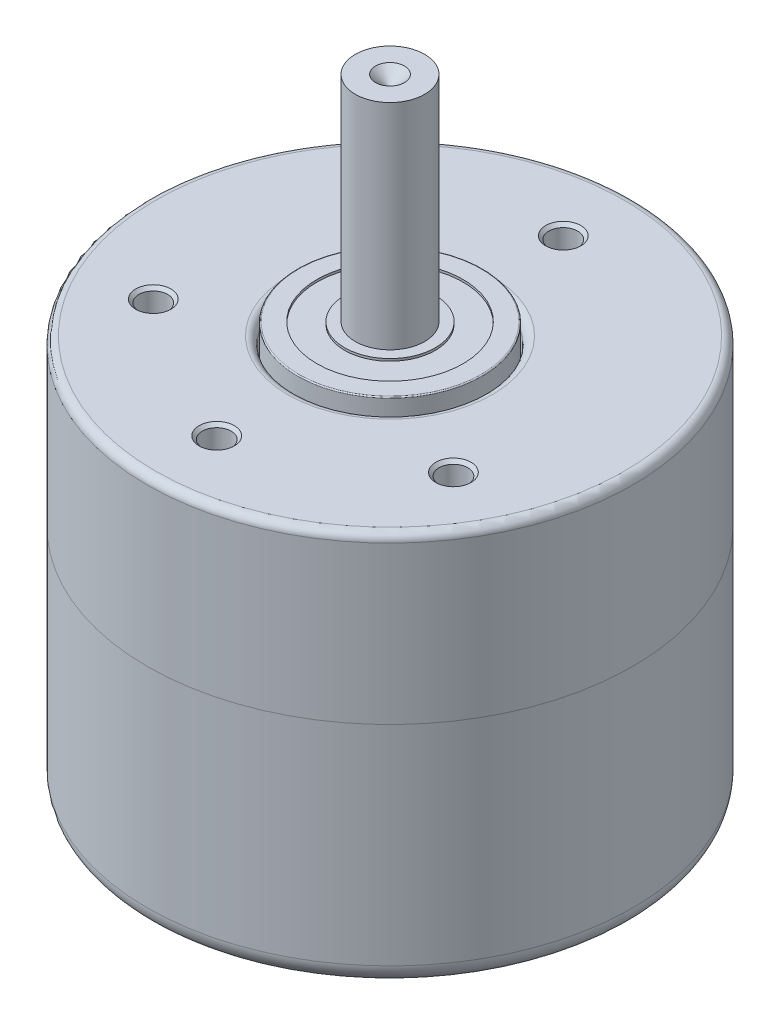
ISO-10303-21;
HEADER;
FILE_DESCRIPTION(('STEP AP214'),'2;1');
FILE_NAME('part.step','',(''),(''),'','','');
FILE_SCHEMA(('AUTOMOTIVE_DESIGN { 1 0 10303 214 1 1 1 1 }'));
ENDSEC;
DATA;
#1=APPLICATION_CONTEXT('core data for automotive mechanical design processes');
#2=APPLICATION_PROTOCOL_DEFINITION('international standard','automotive_design',2000,#1);
#3=PRODUCT_CONTEXT('',#1,'mechanical');
#4=PRODUCT('Part','Part','',(#3));
#5=PRODUCT_RELATED_PRODUCT_CATEGORY('part','',(#4));
#6=PRODUCT_DEFINITION_FORMATION('','',#4);
#7=PRODUCT_DEFINITION_CONTEXT('part definition',#1,'design');
#8=PRODUCT_DEFINITION('design','',#6,#7);
#9=PRODUCT_DEFINITION_SHAPE('','',#8);
#10=(LENGTH_UNIT() NAMED_UNIT(*) SI_UNIT(.MILLI.,.METRE.));
#11=(NAMED_UNIT(*) PLANE_ANGLE_UNIT() SI_UNIT($,.RADIAN.));
#12=(NAMED_UNIT(*) SI_UNIT($,.STERADIAN.) SOLID_ANGLE_UNIT());
#13=UNCERTAINTY_MEASURE_WITH_UNIT(LENGTH_MEASURE(1.E-05),#10,'distance_accuracy_value','');
#14=(GEOMETRIC_REPRESENTATION_CONTEXT(3) GLOBAL_UNCERTAINTY_ASSIGNED_CONTEXT((#13)) GLOBAL_UNIT_ASSIGNED_CONTEXT((#10,
#11,#12)) REPRESENTATION_CONTEXT('',''));
#15=CARTESIAN_POINT('',(0.,0.,0.));
#16=DIRECTION('',(0.,0.,1.));
#17=DIRECTION('',(1.,0.,0.));
#18=AXIS2_PLACEMENT_3D('',#15,#16,#17);
#19=CARTESIAN_POINT('',(0.,-19.85,0.));
#20=DIRECTION('',(0.,1.,0.));
#21=DIRECTION('',(0.,0.,1.));
#22=AXIS2_PLACEMENT_3D('',#19,#20,#21);
#23=CYLINDRICAL_SURFACE('',#22,21.);
#24=CARTESIAN_POINT('',(0.,0.,0.));
#25=DIRECTION('',(0.,-1.,0.));
#26=DIRECTION('',(0.,0.,-1.));
#27=AXIS2_PLACEMENT_3D('',#24,#25,#26);
#28=CIRCLE('',#27,21.);
#29=CARTESIAN_POINT('',(0.,0.,-21.));
#30=VERTEX_POINT('',#29);
#31=EDGE_CURVE('P0_E89',#30,#30,#28,.T.);
#32=ORIENTED_EDGE('',*,*,#31,.T.);
#33=EDGE_LOOP('',(#32));
#34=FACE_BOUND('',#33,.T.);
#35=CARTESIAN_POINT('',(0.,-18.1,0.));
#36=DIRECTION('',(0.,-1.,0.));
#37=DIRECTION('',(0.,0.,-1.));
#38=AXIS2_PLACEMENT_3D('',#35,#36,#37);
#39=CIRCLE('',#38,21.);
#40=CARTESIAN_POINT('',(0.,-18.1,-21.));
#41=VERTEX_POINT('',#40);
#42=EDGE_CURVE('P0_E99',#41,#41,#39,.F.);
#43=ORIENTED_EDGE('',*,*,#42,.T.);
#44=EDGE_LOOP('',(#43));
#45=FACE_BOUND('',#44,.T.);
#46=CARTESIAN_POINT('',(0.,-6.35,0.));
#47=DIRECTION('',(0.,-1.,0.));
#48=DIRECTION('',(0.,0.,-1.));
#49=AXIS2_PLACEMENT_3D('',#46,#47,#48);
#50=CIRCLE('',#49,21.);
#51=CARTESIAN_POINT('',(-20.7903516829014,-6.35,2.95994542201031));
#52=VERTEX_POINT('',#51);
#53=CARTESIAN_POINT('',(-12.9585637707271,-6.35,-16.525));
#54=VERTEX_POINT('',#53);
#55=EDGE_CURVE('P0_E70',#52,#54,#50,.T.);
#56=ORIENTED_EDGE('',*,*,#55,.F.);
#57=DIRECTION('',(0.,-1.,0.));
#58=VECTOR('',#57,1.);
#59=CARTESIAN_POINT('',(-20.7903516829014,-6.35,2.95994542201031));
#60=LINE('',#59,#58);
#61=CARTESIAN_POINT('',(-20.7903516829014,-11.65,2.95994542201031));
#62=VERTEX_POINT('',#61);
#63=EDGE_CURVE('P0_E86',#52,#62,#60,.T.);
#64=ORIENTED_EDGE('',*,*,#63,.T.);
#65=CARTESIAN_POINT('',(0.,-11.65,0.));
#66=DIRECTION('',(0.,-1.,0.));
#67=DIRECTION('',(0.,0.,-1.));
#68=AXIS2_PLACEMENT_3D('',#65,#66,#67);
#69=CIRCLE('',#68,21.);
#70=CARTESIAN_POINT('',(-12.9585637707271,-11.65,-16.525));
#71=VERTEX_POINT('',#70);
#72=EDGE_CURVE('P0_E85',#62,#71,#69,.T.);
#73=ORIENTED_EDGE('',*,*,#72,.T.);
#74=DIRECTION('',(0.,-1.,0.));
#75=VECTOR('',#74,1.);
#76=CARTESIAN_POINT('',(-12.9585637707271,-6.35,-16.525));
#77=LINE('',#76,#75);
#78=EDGE_CURVE('P0_E81',#54,#71,#77,.T.);
#79=ORIENTED_EDGE('',*,*,#78,.F.);
#80=EDGE_LOOP('',(#56,#64,#73,#79));
#81=FACE_BOUND('',#80,.T.);
#82=ADVANCED_FACE('P0_F17',(#34,#45,#81),#23,.T.);
#83=CARTESIAN_POINT('',(0.,-19.85,0.));
#84=DIRECTION('',(0.,-1.,0.));
#85=DIRECTION('',(0.,0.,-1.));
#86=AXIS2_PLACEMENT_3D('',#83,#84,#85);
#87=PLANE('',#86);
#88=CARTESIAN_POINT('',(0.,-19.85,0.));
#89=DIRECTION('',(0.,-1.,0.));
#90=DIRECTION('',(0.,0.,-1.));
#91=AXIS2_PLACEMENT_3D('',#88,#89,#90);
#92=CIRCLE('',#91,19.25);
#93=CARTESIAN_POINT('',(0.,-19.85,-19.25));
#94=VERTEX_POINT('',#93);
#95=EDGE_CURVE('P0_E96',#94,#94,#92,.T.);
#96=ORIENTED_EDGE('',*,*,#95,.T.);
#97=EDGE_LOOP('',(#96));
#98=FACE_BOUND('',#97,.T.);
#99=ADVANCED_FACE('P0_F143',(#98),#87,.T.);
#100=CARTESIAN_POINT('',(0.,0.,0.));
#101=DIRECTION('',(0.,-1.,0.));
#102=DIRECTION('',(0.,0.,-1.));
#103=AXIS2_PLACEMENT_3D('',#100,#101,#102);
#104=PLANE('',#103);
#105=ORIENTED_EDGE('',*,*,#31,.F.);
#106=EDGE_LOOP('',(#105));
#107=FACE_BOUND('',#106,.T.);
#108=ADVANCED_FACE('P0_F149',(#107),#104,.F.);
#109=CARTESIAN_POINT('',(0.,-18.1,0.));
#110=DIRECTION('',(0.,-1.,0.));
#111=DIRECTION('',(0.,0.,-1.));
#112=AXIS2_PLACEMENT_3D('',#109,#110,#111);
#113=TOROIDAL_SURFACE('',#112,19.25,1.75);
#114=ORIENTED_EDGE('',*,*,#42,.F.);
#115=EDGE_LOOP('',(#114));
#116=FACE_BOUND('',#115,.T.);
#117=ORIENTED_EDGE('',*,*,#95,.F.);
#118=EDGE_LOOP('',(#117));
#119=FACE_BOUND('',#118,.T.);
#120=ADVANCED_FACE('P0_F155',(#116,#119),#113,.T.);
#121=CARTESIAN_POINT('',(3.91589395608716,-6.35,-9.74247271100514));
#122=DIRECTION('',(-0.372942281532111,0.,0.927854543905252));
#123=DIRECTION('',(0.927854543905252,0.,0.372942281532111));
#124=AXIS2_PLACEMENT_3D('',#121,#122,#123);
#125=PLANE('',#124);
#126=DIRECTION('',(-0.927854543905252,0.,-0.37294228153211));
#127=VECTOR('',#126,1.);
#128=CARTESIAN_POINT('',(3.91589395608716,-11.65,-9.74247271100514));
#129=LINE('',#128,#127);
#130=CARTESIAN_POINT('',(-19.1876841871536,-11.65,-19.0287355211547));
#131=VERTEX_POINT('',#130);
#132=EDGE_CURVE('P0_E135',#71,#131,#129,.T.);
#133=ORIENTED_EDGE('',*,*,#132,.T.);
#134=DIRECTION('',(0.,1.,0.));
#135=VECTOR('',#134,1.);
#136=CARTESIAN_POINT('',(-19.1876841871536,-6.35,-19.0287355211547));
#137=LINE('',#136,#135);
#138=CARTESIAN_POINT('',(-19.1876841871536,-6.35,-19.0287355211547));
#139=VERTEX_POINT('',#138);
#140=EDGE_CURVE('P0_E11',#131,#139,#137,.T.);
#141=ORIENTED_EDGE('',*,*,#140,.T.);
#142=DIRECTION('',(-0.927854543905252,0.,-0.37294228153211));
#143=VECTOR('',#142,1.);
#144=CARTESIAN_POINT('',(3.91589395608716,-6.35,-9.74247271100514));
#145=LINE('',#144,#143);
#146=EDGE_CURVE('P0_E72',#54,#139,#145,.T.);
#147=ORIENTED_EDGE('',*,*,#146,.F.);
#148=ORIENTED_EDGE('',*,*,#78,.T.);
#149=EDGE_LOOP('',(#133,#141,#147,#148));
#150=FACE_BOUND('',#149,.T.);
#151=ADVANCED_FACE('P0_F80',(#150),#125,.F.);
#152=CARTESIAN_POINT('',(-23.3819345064124,-6.35,-9.39814549460919));
#153=DIRECTION('',(-0.927854543905252,0.,-0.372942281532111));
#154=DIRECTION('',(-0.372942281532111,0.,0.927854543905252));
#155=AXIS2_PLACEMENT_3D('',#152,#153,#154);
#156=PLANE('',#155);
#157=DIRECTION('',(0.372942281532111,0.,-0.927854543905252));
#158=VECTOR('',#157,1.);
#159=CARTESIAN_POINT('',(-23.3819345064124,-11.65,-9.39814549460919));
#160=LINE('',#159,#158);
#161=CARTESIAN_POINT('',(-27.1859457780399,-11.65,0.0659708532244115));
#162=VERTEX_POINT('',#161);
#163=CARTESIAN_POINT('',(-19.5779232347848,-11.65,-18.8622618424427));
#164=VERTEX_POINT('',#163);
#165=EDGE_CURVE('P0_E83',#162,#164,#160,.T.);
#166=ORIENTED_EDGE('',*,*,#165,.F.);
#167=DIRECTION('',(0.,1.,0.));
#168=VECTOR('',#167,1.);
#169=CARTESIAN_POINT('',(-27.1859457780399,-6.35,0.0659708532244081));
#170=LINE('',#169,#168);
#171=CARTESIAN_POINT('',(-27.1859457780399,-6.35,0.0659708532244115));
#172=VERTEX_POINT('',#171);
#173=EDGE_CURVE('P0_E112',#162,#172,#170,.T.);
#174=ORIENTED_EDGE('',*,*,#173,.T.);
#175=DIRECTION('',(0.372942281532111,0.,-0.927854543905252));
#176=VECTOR('',#175,1.);
#177=CARTESIAN_POINT('',(-23.3819345064124,-6.35,-9.39814549460919));
#178=LINE('',#177,#176);
#179=CARTESIAN_POINT('',(-19.5779232347848,-6.35,-18.8622618424427));
#180=VERTEX_POINT('',#179);
#181=EDGE_CURVE('P0_E87',#172,#180,#178,.T.);
#182=ORIENTED_EDGE('',*,*,#181,.T.);
#183=DIRECTION('',(0.,-1.,0.));
#184=VECTOR('',#183,1.);
#185=CARTESIAN_POINT('',(-19.5779232347848,-11.65,-18.8622618424427));
#186=LINE('',#185,#184);
#187=EDGE_CURVE('P0_E109',#180,#164,#186,.T.);
#188=ORIENTED_EDGE('',*,*,#187,.T.);
#189=EDGE_LOOP('',(#166,#174,#182,#188));
#190=FACE_BOUND('',#189,.T.);
#191=ADVANCED_FACE('P0_F130',(#190),#156,.T.);
#192=CARTESIAN_POINT('',(-3.91589395608717,-6.35,9.74247271100517));
#193=DIRECTION('',(-0.372942281532111,0.,0.927854543905252));
#194=DIRECTION('',(0.927854543905252,0.,0.372942281532111));
#195=AXIS2_PLACEMENT_3D('',#192,#193,#194);
#196=PLANE('',#195);
#197=DIRECTION('',(-0.927854543905252,0.,-0.372942281532111));
#198=VECTOR('',#197,1.);
#199=CARTESIAN_POINT('',(-3.91589395608717,-6.35,9.74247271100517));
#200=LINE('',#199,#198);
#201=CARTESIAN_POINT('',(-27.019472099328,-6.35,0.456209900855603));
#202=VERTEX_POINT('',#201);
#203=EDGE_CURVE('P0_E74',#52,#202,#200,.T.);
#204=ORIENTED_EDGE('',*,*,#203,.T.);
#205=DIRECTION('',(0.,-1.,0.));
#206=VECTOR('',#205,1.);
#207=CARTESIAN_POINT('',(-27.019472099328,-6.35,0.456209900855603));
#208=LINE('',#207,#206);
#209=CARTESIAN_POINT('',(-27.019472099328,-11.65,0.456209900855603));
#210=VERTEX_POINT('',#209);
#211=EDGE_CURVE('P0_E102',#202,#210,#208,.T.);
#212=ORIENTED_EDGE('',*,*,#211,.T.);
#213=DIRECTION('',(-0.927854543905252,0.,-0.372942281532111));
#214=VECTOR('',#213,1.);
#215=CARTESIAN_POINT('',(-3.91589395608717,-11.65,9.74247271100517));
#216=LINE('',#215,#214);
#217=EDGE_CURVE('P0_E128',#62,#210,#216,.T.);
#218=ORIENTED_EDGE('',*,*,#217,.F.);
#219=ORIENTED_EDGE('',*,*,#63,.F.);
#220=EDGE_LOOP('',(#204,#212,#218,#219));
#221=FACE_BOUND('',#220,.T.);
#222=ADVANCED_FACE('P0_F119',(#221),#196,.T.);
#223=CARTESIAN_POINT('',(0.,-6.35,0.));
#224=DIRECTION('',(0.,-1.,0.));
#225=DIRECTION('',(0.,0.,-1.));
#226=AXIS2_PLACEMENT_3D('',#223,#224,#225);
#227=PLANE('',#226);
#228=ORIENTED_EDGE('',*,*,#181,.F.);
#229=DIRECTION('',(-0.392382223687617,0.,-0.919802256212693));
#230=VECTOR('',#229,1.);
#231=CARTESIAN_POINT('',(-27.019472099328,-6.35,0.456209900855603));
#232=LINE('',#231,#230);
#233=EDGE_CURVE('P0_E25',#172,#202,#232,.F.);
#234=ORIENTED_EDGE('',*,*,#233,.T.);
#235=ORIENTED_EDGE('',*,*,#203,.F.);
#236=ORIENTED_EDGE('',*,*,#55,.T.);
#237=ORIENTED_EDGE('',*,*,#146,.T.);
#238=DIRECTION('',(-0.919802256212698,0.,0.392382223687606));
#239=VECTOR('',#238,1.);
#240=CARTESIAN_POINT('',(-19.5779232347848,-6.35,-18.8622618424427));
#241=LINE('',#240,#239);
#242=EDGE_CURVE('P0_E37',#139,#180,#241,.T.);
#243=ORIENTED_EDGE('',*,*,#242,.T.);
#244=EDGE_LOOP('',(#228,#234,#235,#236,#237,#243));
#245=FACE_BOUND('',#244,.T.);
#246=ADVANCED_FACE('P0_F71',(#245),#227,.F.);
#247=CARTESIAN_POINT('',(0.,-11.65,0.));
#248=DIRECTION('',(0.,-1.,0.));
#249=DIRECTION('',(0.,0.,-1.));
#250=AXIS2_PLACEMENT_3D('',#247,#248,#249);
#251=PLANE('',#250);
#252=ORIENTED_EDGE('',*,*,#217,.T.);
#253=DIRECTION('',(0.392382223687617,0.,0.919802256212693));
#254=VECTOR('',#253,1.);
#255=CARTESIAN_POINT('',(-23.0241038102413,-11.65,9.8219470440046));
#256=LINE('',#255,#254);
#257=EDGE_CURVE('P0_E107',#210,#162,#256,.F.);
#258=ORIENTED_EDGE('',*,*,#257,.T.);
#259=ORIENTED_EDGE('',*,*,#165,.T.);
#260=DIRECTION('',(0.919802256212698,0.,-0.392382223687606));
#261=VECTOR('',#260,1.);
#262=CARTESIAN_POINT('',(-9.82194704400427,-11.65,-23.0241038102413));
#263=LINE('',#262,#261);
#264=EDGE_CURVE('P0_E105',#164,#131,#263,.T.);
#265=ORIENTED_EDGE('',*,*,#264,.T.);
#266=ORIENTED_EDGE('',*,*,#132,.F.);
#267=ORIENTED_EDGE('',*,*,#72,.F.);
#268=EDGE_LOOP('',(#252,#258,#259,#265,#266,#267));
#269=FACE_BOUND('',#268,.T.);
#270=ADVANCED_FACE('P0_F127',(#269),#251,.T.);
#271=CARTESIAN_POINT('',(-27.019472099328,-6.35,0.456209900855603));
#272=DIRECTION('',(0.919802256212693,0.,-0.392382223687617));
#273=DIRECTION('',(0.,-1.,0.));
#274=AXIS2_PLACEMENT_3D('',#271,#272,#273);
#275=PLANE('',#274);
#276=ORIENTED_EDGE('',*,*,#233,.F.);
#277=ORIENTED_EDGE('',*,*,#173,.F.);
#278=ORIENTED_EDGE('',*,*,#257,.F.);
#279=ORIENTED_EDGE('',*,*,#211,.F.);
#280=EDGE_LOOP('',(#276,#277,#278,#279));
#281=FACE_BOUND('',#280,.T.);
#282=ADVANCED_FACE('P0_F123',(#281),#275,.F.);
#283=CARTESIAN_POINT('',(-19.5779232347848,-6.35,-18.8622618424427));
#284=DIRECTION('',(-0.392382223687606,0.,-0.919802256212698));
#285=DIRECTION('',(0.,1.,0.));
#286=AXIS2_PLACEMENT_3D('',#283,#284,#285);
#287=PLANE('',#286);
#288=ORIENTED_EDGE('',*,*,#242,.F.);
#289=ORIENTED_EDGE('',*,*,#140,.F.);
#290=ORIENTED_EDGE('',*,*,#264,.F.);
#291=ORIENTED_EDGE('',*,*,#187,.F.);
#292=EDGE_LOOP('',(#288,#289,#290,#291));
#293=FACE_BOUND('',#292,.T.);
#294=ADVANCED_FACE('P0_F19',(#293),#287,.T.);
#295=CLOSED_SHELL('',(#82,#99,#108,#120,#151,#191,#222,#246,#270,#282,#294));
#296=MANIFOLD_SOLID_BREP('P0_B1',#295);
#297=CARTESIAN_POINT('',(-3.91589395608717,-5.15,9.74247271100517));
#298=DIRECTION('',(-0.372942281532111,0.,0.927854543905252));
#299=DIRECTION('',(0.927854543905252,0.,0.372942281532111));
#300=AXIS2_PLACEMENT_3D('',#297,#298,#299);
#301=PLANE('',#300);
#302=DIRECTION('',(-0.927854543905252,0.,-0.372942281532111));
#303=VECTOR('',#302,1.);
#304=CARTESIAN_POINT('',(-3.91589395608717,-5.15,9.74247271100517));
#305=LINE('',#304,#303);
#306=CARTESIAN_POINT('',(-20.7903516829014,-5.15,2.95994542201031));
#307=VERTEX_POINT('',#306);
#308=CARTESIAN_POINT('',(-27.019472099328,-5.15,0.456209900855604));
#309=VERTEX_POINT('',#308);
#310=EDGE_CURVE('P1_E77',#307,#309,#305,.T.);
#311=ORIENTED_EDGE('',*,*,#310,.T.);
#312=DIRECTION('',(0.,-1.,0.));
#313=VECTOR('',#312,1.);
#314=CARTESIAN_POINT('',(-27.019472099328,-5.15,0.456209900855604));
#315=LINE('',#314,#313);
#316=CARTESIAN_POINT('',(-27.019472099328,-6.35,0.456209900855604));
#317=VERTEX_POINT('',#316);
#318=EDGE_CURVE('P1_E11',#309,#317,#315,.T.);
#319=ORIENTED_EDGE('',*,*,#318,.T.);
#320=DIRECTION('',(-0.927854543905252,0.,-0.372942281532111));
#321=VECTOR('',#320,1.);
#322=CARTESIAN_POINT('',(-3.91589395608717,-6.35,9.74247271100517));
#323=LINE('',#322,#321);
#324=CARTESIAN_POINT('',(-20.7903516829014,-6.35,2.95994542201031));
#325=VERTEX_POINT('',#324);
#326=EDGE_CURVE('P1_E95',#325,#317,#323,.T.);
#327=ORIENTED_EDGE('',*,*,#326,.F.);
#328=DIRECTION('',(0.,-1.,0.));
#329=VECTOR('',#328,1.);
#330=CARTESIAN_POINT('',(-20.7903516829014,-5.15,2.95994542201031));
#331=LINE('',#330,#329);
#332=EDGE_CURVE('P1_E86',#307,#325,#331,.T.);
#333=ORIENTED_EDGE('',*,*,#332,.F.);
#334=EDGE_LOOP('',(#311,#319,#327,#333));
#335=FACE_BOUND('',#334,.T.);
#336=ADVANCED_FACE('P1_F17',(#335),#301,.T.);
#337=CARTESIAN_POINT('',(0.,-5.15,0.));
#338=DIRECTION('',(0.,-1.,0.));
#339=DIRECTION('',(0.,0.,-1.));
#340=AXIS2_PLACEMENT_3D('',#337,#338,#339);
#341=CYLINDRICAL_SURFACE('',#340,21.);
#342=CARTESIAN_POINT('',(0.,-6.35,0.));
#343=DIRECTION('',(0.,-1.,0.));
#344=DIRECTION('',(0.,0.,-1.));
#345=AXIS2_PLACEMENT_3D('',#342,#343,#344);
#346=CIRCLE('',#345,21.);
#347=CARTESIAN_POINT('',(-12.9585637707271,-6.35,-16.525));
#348=VERTEX_POINT('',#347);
#349=EDGE_CURVE('P1_E84',#325,#348,#346,.T.);
#350=ORIENTED_EDGE('',*,*,#349,.T.);
#351=DIRECTION('',(0.,-1.,0.));
#352=VECTOR('',#351,1.);
#353=CARTESIAN_POINT('',(-12.9585637707271,-5.15,-16.525));
#354=LINE('',#353,#352);
#355=CARTESIAN_POINT('',(-12.9585637707271,-5.15,-16.525));
#356=VERTEX_POINT('',#355);
#357=EDGE_CURVE('P1_E79',#356,#348,#354,.T.);
#358=ORIENTED_EDGE('',*,*,#357,.F.);
#359=CARTESIAN_POINT('',(0.,-5.15,0.));
#360=DIRECTION('',(0.,-1.,0.));
#361=DIRECTION('',(0.,0.,-1.));
#362=AXIS2_PLACEMENT_3D('',#359,#360,#361);
#363=CIRCLE('',#362,21.);
#364=EDGE_CURVE('P1_E72',#307,#356,#363,.T.);
#365=ORIENTED_EDGE('',*,*,#364,.F.);
#366=ORIENTED_EDGE('',*,*,#332,.T.);
#367=EDGE_LOOP('',(#350,#358,#365,#366));
#368=FACE_BOUND('',#367,.T.);
#369=ADVANCED_FACE('P1_F82',(#368),#341,.F.);
#370=CARTESIAN_POINT('',(3.91589395608716,-5.15,-9.74247271100514));
#371=DIRECTION('',(-0.37294228153211,0.,0.927854543905252));
#372=DIRECTION('',(0.927854543905252,0.,0.37294228153211));
#373=AXIS2_PLACEMENT_3D('',#370,#371,#372);
#374=PLANE('',#373);
#375=DIRECTION('',(-0.927854543905253,0.,-0.372942281532111));
#376=VECTOR('',#375,1.);
#377=CARTESIAN_POINT('',(3.91589395608716,-6.35,-9.74247271100514));
#378=LINE('',#377,#376);
#379=CARTESIAN_POINT('',(-19.1876841871536,-6.35,-19.0287355211547));
#380=VERTEX_POINT('',#379);
#381=EDGE_CURVE('P1_E101',#348,#380,#378,.T.);
#382=ORIENTED_EDGE('',*,*,#381,.T.);
#383=DIRECTION('',(0.,1.,0.));
#384=VECTOR('',#383,1.);
#385=CARTESIAN_POINT('',(-19.1876841871536,-5.15,-19.0287355211547));
#386=LINE('',#385,#384);
#387=CARTESIAN_POINT('',(-19.1876841871536,-5.15,-19.0287355211547));
#388=VERTEX_POINT('',#387);
#389=EDGE_CURVE('P1_E40',#380,#388,#386,.T.);
#390=ORIENTED_EDGE('',*,*,#389,.T.);
#391=DIRECTION('',(-0.927854543905253,0.,-0.372942281532111));
#392=VECTOR('',#391,1.);
#393=CARTESIAN_POINT('',(3.91589395608716,-5.15,-9.74247271100514));
#394=LINE('',#393,#392);
#395=EDGE_CURVE('P1_E75',#356,#388,#394,.T.);
#396=ORIENTED_EDGE('',*,*,#395,.F.);
#397=ORIENTED_EDGE('',*,*,#357,.T.);
#398=EDGE_LOOP('',(#382,#390,#396,#397));
#399=FACE_BOUND('',#398,.T.);
#400=ADVANCED_FACE('P1_F88',(#399),#374,.F.);
#401=CARTESIAN_POINT('',(-23.3819345064124,-5.15,-9.39814549460919));
#402=DIRECTION('',(-0.927854543905252,0.,-0.372942281532111));
#403=DIRECTION('',(-0.372942281532111,0.,0.927854543905252));
#404=AXIS2_PLACEMENT_3D('',#401,#402,#403);
#405=PLANE('',#404);
#406=DIRECTION('',(0.372942281532111,0.,-0.927854543905252));
#407=VECTOR('',#406,1.);
#408=CARTESIAN_POINT('',(-23.3819345064124,-5.15,-9.39814549460919));
#409=LINE('',#408,#407);
#410=CARTESIAN_POINT('',(-27.1859457780399,-5.15,0.0659708532243976));
#411=VERTEX_POINT('',#410);
#412=CARTESIAN_POINT('',(-19.5779232347848,-5.15,-18.8622618424428));
#413=VERTEX_POINT('',#412);
#414=EDGE_CURVE('P1_E89',#411,#413,#409,.T.);
#415=ORIENTED_EDGE('',*,*,#414,.T.);
#416=DIRECTION('',(0.,-1.,0.));
#417=VECTOR('',#416,1.);
#418=CARTESIAN_POINT('',(-19.5779232347848,-6.35,-18.8622618424427));
#419=LINE('',#418,#417);
#420=CARTESIAN_POINT('',(-19.5779232347848,-6.35,-18.8622618424428));
#421=VERTEX_POINT('',#420);
#422=EDGE_CURVE('P1_E107',#413,#421,#419,.T.);
#423=ORIENTED_EDGE('',*,*,#422,.T.);
#424=DIRECTION('',(0.372942281532111,0.,-0.927854543905252));
#425=VECTOR('',#424,1.);
#426=CARTESIAN_POINT('',(-23.3819345064124,-6.35,-9.39814549460919));
#427=LINE('',#426,#425);
#428=CARTESIAN_POINT('',(-27.1859457780399,-6.35,0.0659708532243976));
#429=VERTEX_POINT('',#428);
#430=EDGE_CURVE('P1_E98',#429,#421,#427,.T.);
#431=ORIENTED_EDGE('',*,*,#430,.F.);
#432=DIRECTION('',(0.,1.,0.));
#433=VECTOR('',#432,1.);
#434=CARTESIAN_POINT('',(-27.1859457780399,-5.15,0.0659708532243959));
#435=LINE('',#434,#433);
#436=EDGE_CURVE('P1_E104',#429,#411,#435,.T.);
#437=ORIENTED_EDGE('',*,*,#436,.T.);
#438=EDGE_LOOP('',(#415,#423,#431,#437));
#439=FACE_BOUND('',#438,.T.);
#440=ADVANCED_FACE('P1_F118',(#439),#405,.T.);
#441=CARTESIAN_POINT('',(0.,-5.15,0.));
#442=DIRECTION('',(0.,-1.,0.));
#443=DIRECTION('',(0.,0.,-1.));
#444=AXIS2_PLACEMENT_3D('',#441,#442,#443);
#445=PLANE('',#444);
#446=ORIENTED_EDGE('',*,*,#395,.T.);
#447=DIRECTION('',(-0.9198022562127,0.,0.392382223687602));
#448=VECTOR('',#447,1.);
#449=CARTESIAN_POINT('',(-19.5779232347848,-5.15,-18.8622618424427));
#450=LINE('',#449,#448);
#451=EDGE_CURVE('P1_E25',#388,#413,#450,.T.);
#452=ORIENTED_EDGE('',*,*,#451,.T.);
#453=ORIENTED_EDGE('',*,*,#414,.F.);
#454=DIRECTION('',(-0.392382223687608,0.,-0.919802256212697));
#455=VECTOR('',#454,1.);
#456=CARTESIAN_POINT('',(-27.019472099328,-5.15,0.456209900855604));
#457=LINE('',#456,#455);
#458=EDGE_CURVE('P1_E32',#411,#309,#457,.F.);
#459=ORIENTED_EDGE('',*,*,#458,.T.);
#460=ORIENTED_EDGE('',*,*,#310,.F.);
#461=ORIENTED_EDGE('',*,*,#364,.T.);
#462=EDGE_LOOP('',(#446,#452,#453,#459,#460,#461));
#463=FACE_BOUND('',#462,.T.);
#464=ADVANCED_FACE('P1_F74',(#463),#445,.F.);
#465=CARTESIAN_POINT('',(0.,-6.35,0.));
#466=DIRECTION('',(0.,-1.,0.));
#467=DIRECTION('',(0.,0.,-1.));
#468=AXIS2_PLACEMENT_3D('',#465,#466,#467);
#469=PLANE('',#468);
#470=ORIENTED_EDGE('',*,*,#430,.T.);
#471=DIRECTION('',(0.9198022562127,0.,-0.392382223687602));
#472=VECTOR('',#471,1.);
#473=CARTESIAN_POINT('',(-9.82194704400415,-6.35,-23.0241038102413));
#474=LINE('',#473,#472);
#475=EDGE_CURVE('P1_E112',#421,#380,#474,.T.);
#476=ORIENTED_EDGE('',*,*,#475,.T.);
#477=ORIENTED_EDGE('',*,*,#381,.F.);
#478=ORIENTED_EDGE('',*,*,#349,.F.);
#479=ORIENTED_EDGE('',*,*,#326,.T.);
#480=DIRECTION('',(0.392382223687608,0.,0.919802256212697));
#481=VECTOR('',#480,1.);
#482=CARTESIAN_POINT('',(-23.0241038102415,-6.35,9.82194704400442));
#483=LINE('',#482,#481);
#484=EDGE_CURVE('P1_E110',#317,#429,#483,.F.);
#485=ORIENTED_EDGE('',*,*,#484,.T.);
#486=EDGE_LOOP('',(#470,#476,#477,#478,#479,#485));
#487=FACE_BOUND('',#486,.T.);
#488=ADVANCED_FACE('P1_F123',(#487),#469,.T.);
#489=CARTESIAN_POINT('',(-19.5779232347848,-5.15,-18.8622618424427));
#490=DIRECTION('',(-0.392382223687602,0.,-0.9198022562127));
#491=DIRECTION('',(0.,1.,0.));
#492=AXIS2_PLACEMENT_3D('',#489,#490,#491);
#493=PLANE('',#492);
#494=ORIENTED_EDGE('',*,*,#451,.F.);
#495=ORIENTED_EDGE('',*,*,#389,.F.);
#496=ORIENTED_EDGE('',*,*,#475,.F.);
#497=ORIENTED_EDGE('',*,*,#422,.F.);
#498=EDGE_LOOP('',(#494,#495,#496,#497));
#499=FACE_BOUND('',#498,.T.);
#500=ADVANCED_FACE('P1_F121',(#499),#493,.T.);
#501=CARTESIAN_POINT('',(-27.019472099328,-5.15,0.456209900855604));
#502=DIRECTION('',(0.919802256212697,0.,-0.392382223687608));
#503=DIRECTION('',(0.,-1.,0.));
#504=AXIS2_PLACEMENT_3D('',#501,#502,#503);
#505=PLANE('',#504);
#506=ORIENTED_EDGE('',*,*,#458,.F.);
#507=ORIENTED_EDGE('',*,*,#436,.F.);
#508=ORIENTED_EDGE('',*,*,#484,.F.);
#509=ORIENTED_EDGE('',*,*,#318,.F.);
#510=EDGE_LOOP('',(#506,#507,#508,#509));
#511=FACE_BOUND('',#510,.T.);
#512=ADVANCED_FACE('P1_F19',(#511),#505,.F.);
#513=CLOSED_SHELL('',(#336,#369,#400,#440,#464,#488,#500,#512));
#514=MANIFOLD_SOLID_BREP('P1_B1',#513);
#515=CARTESIAN_POINT('',(0.,14.3,0.));
#516=DIRECTION('',(0.,-1.,0.));
#517=DIRECTION('',(0.,0.,-1.));
#518=AXIS2_PLACEMENT_3D('',#515,#516,#517);
#519=CYLINDRICAL_SURFACE('',#518,21.);
#520=CARTESIAN_POINT('',(0.,13.6,0.));
#521=DIRECTION('',(0.,1.,0.));
#522=DIRECTION('',(0.,0.,1.));
#523=AXIS2_PLACEMENT_3D('',#520,#521,#522);
#524=CIRCLE('',#523,21.);
#525=CARTESIAN_POINT('',(0.,13.6,21.));
#526=VERTEX_POINT('',#525);
#527=EDGE_CURVE('P2_E108',#526,#526,#524,.F.);
#528=ORIENTED_EDGE('',*,*,#527,.T.);
#529=EDGE_LOOP('',(#528));
#530=FACE_BOUND('',#529,.T.);
#531=CARTESIAN_POINT('',(0.,0.,0.));
#532=DIRECTION('',(0.,1.,0.));
#533=DIRECTION('',(0.,0.,1.));
#534=AXIS2_PLACEMENT_3D('',#531,#532,#533);
#535=CIRCLE('',#534,21.);
#536=CARTESIAN_POINT('',(0.,0.,21.));
#537=VERTEX_POINT('',#536);
#538=EDGE_CURVE('P2_E102',#537,#537,#535,.T.);
#539=ORIENTED_EDGE('',*,*,#538,.T.);
#540=EDGE_LOOP('',(#539));
#541=FACE_BOUND('',#540,.T.);
#542=ADVANCED_FACE('P2_F16',(#530,#541),#519,.T.);
#543=CARTESIAN_POINT('',(0.,14.3,0.));
#544=DIRECTION('',(0.,1.,0.));
#545=DIRECTION('',(0.,0.,1.));
#546=AXIS2_PLACEMENT_3D('',#543,#544,#545);
#547=PLANE('',#546);
#548=CARTESIAN_POINT('',(0.,14.3,-15.));
#549=DIRECTION('',(0.,1.,0.));
#550=DIRECTION('',(0.,0.,1.));
#551=AXIS2_PLACEMENT_3D('',#548,#549,#550);
#552=CIRCLE('',#551,1.525);
#553=CARTESIAN_POINT('',(0.,14.3,-13.475));
#554=VERTEX_POINT('',#553);
#555=EDGE_CURVE('P2_E54',#554,#554,#552,.T.);
#556=ORIENTED_EDGE('',*,*,#555,.F.);
#557=EDGE_LOOP('',(#556));
#558=FACE_BOUND('',#557,.T.);
#559=CARTESIAN_POINT('',(-12.9903810567656,14.3,7.50000000000056));
#560=DIRECTION('',(0.,1.,0.));
#561=DIRECTION('',(0.,0.,1.));
#562=AXIS2_PLACEMENT_3D('',#559,#560,#561);
#563=CIRCLE('',#562,1.525);
#564=CARTESIAN_POINT('',(-12.9903810567656,14.3,9.02500000000056));
#565=VERTEX_POINT('',#564);
#566=EDGE_CURVE('P2_E47',#565,#565,#563,.T.);
#567=ORIENTED_EDGE('',*,*,#566,.F.);
#568=EDGE_LOOP('',(#567));
#569=FACE_BOUND('',#568,.T.);
#570=CARTESIAN_POINT('',(12.9903810567675,14.3,7.49999999999944));
#571=DIRECTION('',(0.,1.,0.));
#572=DIRECTION('',(0.,0.,1.));
#573=AXIS2_PLACEMENT_3D('',#570,#571,#572);
#574=CIRCLE('',#573,1.525);
#575=CARTESIAN_POINT('',(12.9903810567675,14.3,9.02499999999944));
#576=VERTEX_POINT('',#575);
#577=EDGE_CURVE('P2_E63',#576,#576,#574,.T.);
#578=ORIENTED_EDGE('',*,*,#577,.F.);
#579=EDGE_LOOP('',(#578));
#580=FACE_BOUND('',#579,.T.);
#581=CARTESIAN_POINT('',(-1.04744440165294E-13,14.3,15.));
#582=DIRECTION('',(0.,1.,0.));
#583=DIRECTION('',(0.,0.,1.));
#584=AXIS2_PLACEMENT_3D('',#581,#582,#583);
#585=CIRCLE('',#584,1.525);
#586=CARTESIAN_POINT('',(-1.04744440165294E-13,14.3,16.525));
#587=VERTEX_POINT('',#586);
#588=EDGE_CURVE('P2_E72',#587,#587,#585,.T.);
#589=ORIENTED_EDGE('',*,*,#588,.F.);
#590=EDGE_LOOP('',(#589));
#591=FACE_BOUND('',#590,.T.);
#592=CARTESIAN_POINT('',(0.,14.3,0.));
#593=DIRECTION('',(0.,1.,0.));
#594=DIRECTION('',(0.,0.,1.));
#595=AXIS2_PLACEMENT_3D('',#592,#593,#594);
#596=CIRCLE('',#595,8.85);
#597=CARTESIAN_POINT('',(0.,14.3,8.85));
#598=VERTEX_POINT('',#597);
#599=EDGE_CURVE('P2_E114',#598,#598,#596,.F.);
#600=ORIENTED_EDGE('',*,*,#599,.T.);
#601=EDGE_LOOP('',(#600));
#602=FACE_BOUND('',#601,.T.);
#603=CARTESIAN_POINT('',(0.,14.3,0.));
#604=DIRECTION('',(0.,1.,0.));
#605=DIRECTION('',(0.,0.,1.));
#606=AXIS2_PLACEMENT_3D('',#603,#604,#605);
#607=CIRCLE('',#606,20.3);
#608=CARTESIAN_POINT('',(0.,14.3,20.3));
#609=VERTEX_POINT('',#608);
#610=EDGE_CURVE('P2_E105',#609,#609,#607,.T.);
#611=ORIENTED_EDGE('',*,*,#610,.T.);
#612=EDGE_LOOP('',(#611));
#613=FACE_BOUND('',#612,.T.);
#614=ADVANCED_FACE('P2_F141',(#558,#569,#580,#591,#602,#613),#547,.T.);
#615=CARTESIAN_POINT('',(0.,0.,0.));
#616=DIRECTION('',(0.,1.,0.));
#617=DIRECTION('',(0.,0.,1.));
#618=AXIS2_PLACEMENT_3D('',#615,#616,#617);
#619=PLANE('',#618);
#620=ORIENTED_EDGE('',*,*,#538,.F.);
#621=EDGE_LOOP('',(#620));
#622=FACE_BOUND('',#621,.T.);
#623=ADVANCED_FACE('P2_F147',(#622),#619,.F.);
#624=CARTESIAN_POINT('',(0.,13.6,0.));
#625=DIRECTION('',(0.,1.,0.));
#626=DIRECTION('',(0.,0.,1.));
#627=AXIS2_PLACEMENT_3D('',#624,#625,#626);
#628=TOROIDAL_SURFACE('',#627,20.3,0.7);
#629=ORIENTED_EDGE('',*,*,#527,.F.);
#630=EDGE_LOOP('',(#629));
#631=FACE_BOUND('',#630,.T.);
#632=ORIENTED_EDGE('',*,*,#610,.F.);
#633=EDGE_LOOP('',(#632));
#634=FACE_BOUND('',#633,.T.);
#635=ADVANCED_FACE('P2_F153',(#631,#634),#628,.T.);
#636=CARTESIAN_POINT('',(0.,10.36,0.));
#637=DIRECTION('',(0.,1.,0.));
#638=DIRECTION('',(0.,0.,1.));
#639=AXIS2_PLACEMENT_3D('',#636,#637,#638);
#640=CYLINDRICAL_SURFACE('',#639,8.15);
#641=CARTESIAN_POINT('',(0.,13.6,0.));
#642=DIRECTION('',(0.,1.,0.));
#643=DIRECTION('',(0.,0.,1.));
#644=AXIS2_PLACEMENT_3D('',#641,#642,#643);
#645=CIRCLE('',#644,8.15);
#646=CARTESIAN_POINT('',(0.,13.6,8.15));
#647=VERTEX_POINT('',#646);
#648=EDGE_CURVE('P2_E111',#647,#647,#645,.T.);
#649=ORIENTED_EDGE('',*,*,#648,.T.);
#650=EDGE_LOOP('',(#649));
#651=FACE_BOUND('',#650,.T.);
#652=CARTESIAN_POINT('',(0.,10.36,0.));
#653=DIRECTION('',(0.,1.,0.));
#654=DIRECTION('',(0.,0.,1.));
#655=AXIS2_PLACEMENT_3D('',#652,#653,#654);
#656=CIRCLE('',#655,8.15);
#657=CARTESIAN_POINT('',(0.,10.36,8.15));
#658=VERTEX_POINT('',#657);
#659=EDGE_CURVE('P2_E96',#658,#658,#656,.T.);
#660=ORIENTED_EDGE('',*,*,#659,.F.);
#661=EDGE_LOOP('',(#660));
#662=FACE_BOUND('',#661,.T.);
#663=ADVANCED_FACE('P2_F155',(#651,#662),#640,.F.);
#664=CARTESIAN_POINT('',(0.,10.36,0.));
#665=DIRECTION('',(0.,1.,0.));
#666=DIRECTION('',(0.,0.,1.));
#667=AXIS2_PLACEMENT_3D('',#664,#665,#666);
#668=PLANE('',#667);
#669=CARTESIAN_POINT('',(0.,10.36,0.));
#670=DIRECTION('',(0.,1.,0.));
#671=DIRECTION('',(0.,0.,1.));
#672=AXIS2_PLACEMENT_3D('',#669,#670,#671);
#673=CIRCLE('',#672,8.);
#674=CARTESIAN_POINT('',(0.,10.36,8.));
#675=VERTEX_POINT('',#674);
#676=EDGE_CURVE('P2_E117',#675,#675,#673,.T.);
#677=ORIENTED_EDGE('',*,*,#676,.F.);
#678=EDGE_LOOP('',(#677));
#679=FACE_BOUND('',#678,.T.);
#680=ORIENTED_EDGE('',*,*,#659,.T.);
#681=EDGE_LOOP('',(#680));
#682=FACE_BOUND('',#681,.T.);
#683=ADVANCED_FACE('P2_F160',(#679,#682),#668,.T.);
#684=CARTESIAN_POINT('',(0.,13.6,0.));
#685=DIRECTION('',(0.,1.,0.));
#686=DIRECTION('',(0.,0.,1.));
#687=AXIS2_PLACEMENT_3D('',#684,#685,#686);
#688=TOROIDAL_SURFACE('',#687,8.85,0.7);
#689=ORIENTED_EDGE('',*,*,#599,.F.);
#690=EDGE_LOOP('',(#689));
#691=FACE_BOUND('',#690,.T.);
#692=ORIENTED_EDGE('',*,*,#648,.F.);
#693=EDGE_LOOP('',(#692));
#694=FACE_BOUND('',#693,.T.);
#695=ADVANCED_FACE('P2_F157',(#691,#694),#688,.T.);
#696=CARTESIAN_POINT('',(0.,10.36,0.));
#697=DIRECTION('',(0.,1.,0.));
#698=DIRECTION('',(0.,0.,1.));
#699=AXIS2_PLACEMENT_3D('',#696,#697,#698);
#700=CYLINDRICAL_SURFACE('',#699,8.);
#701=CARTESIAN_POINT('',(0.,15.26,0.));
#702=DIRECTION('',(0.,1.,0.));
#703=DIRECTION('',(0.,0.,1.));
#704=AXIS2_PLACEMENT_3D('',#701,#702,#703);
#705=CIRCLE('',#704,8.);
#706=CARTESIAN_POINT('',(0.,15.26,8.));
#707=VERTEX_POINT('',#706);
#708=EDGE_CURVE('P2_E10',#707,#707,#705,.F.);
#709=ORIENTED_EDGE('',*,*,#708,.T.);
#710=EDGE_LOOP('',(#709));
#711=FACE_BOUND('',#710,.T.);
#712=ORIENTED_EDGE('',*,*,#676,.T.);
#713=EDGE_LOOP('',(#712));
#714=FACE_BOUND('',#713,.T.);
#715=ADVANCED_FACE('P2_F159',(#711,#714),#700,.T.);
#716=CARTESIAN_POINT('',(0.,15.36,0.));
#717=DIRECTION('',(0.,1.,0.));
#718=DIRECTION('',(0.,0.,1.));
#719=AXIS2_PLACEMENT_3D('',#716,#717,#718);
#720=PLANE('',#719);
#721=CARTESIAN_POINT('',(0.,15.36,0.));
#722=DIRECTION('',(0.,1.,0.));
#723=DIRECTION('',(0.,0.,1.));
#724=AXIS2_PLACEMENT_3D('',#721,#722,#723);
#725=CIRCLE('',#724,7.9);
#726=CARTESIAN_POINT('',(0.,15.36,7.9));
#727=VERTEX_POINT('',#726);
#728=EDGE_CURVE('P2_E24',#727,#727,#725,.T.);
#729=ORIENTED_EDGE('',*,*,#728,.T.);
#730=EDGE_LOOP('',(#729));
#731=FACE_BOUND('',#730,.T.);
#732=CARTESIAN_POINT('',(0.,15.36,0.));
#733=DIRECTION('',(0.,1.,0.));
#734=DIRECTION('',(0.,0.,1.));
#735=AXIS2_PLACEMENT_3D('',#732,#733,#734);
#736=CIRCLE('',#735,6.325);
#737=CARTESIAN_POINT('',(0.,15.36,6.325));
#738=VERTEX_POINT('',#737);
#739=EDGE_CURVE('P2_E85',#738,#738,#736,.T.);
#740=ORIENTED_EDGE('',*,*,#739,.F.);
#741=EDGE_LOOP('',(#740));
#742=FACE_BOUND('',#741,.T.);
#743=ADVANCED_FACE('P2_F122',(#731,#742),#720,.T.);
#744=CARTESIAN_POINT('',(0.,15.16,0.));
#745=DIRECTION('',(0.,1.,0.));
#746=DIRECTION('',(0.,0.,1.));
#747=AXIS2_PLACEMENT_3D('',#744,#745,#746);
#748=CYLINDRICAL_SURFACE('',#747,6.325);
#749=CARTESIAN_POINT('',(0.,15.16,0.));
#750=DIRECTION('',(0.,1.,0.));
#751=DIRECTION('',(0.,0.,1.));
#752=AXIS2_PLACEMENT_3D('',#749,#750,#751);
#753=CIRCLE('',#752,6.325);
#754=CARTESIAN_POINT('',(0.,15.16,6.325));
#755=VERTEX_POINT('',#754);
#756=EDGE_CURVE('P2_E88',#755,#755,#753,.T.);
#757=ORIENTED_EDGE('',*,*,#756,.F.);
#758=EDGE_LOOP('',(#757));
#759=FACE_BOUND('',#758,.T.);
#760=ORIENTED_EDGE('',*,*,#739,.T.);
#761=EDGE_LOOP('',(#760));
#762=FACE_BOUND('',#761,.T.);
#763=ADVANCED_FACE('P2_F205',(#759,#762),#748,.F.);
#764=CARTESIAN_POINT('',(0.,15.16,0.));
#765=DIRECTION('',(0.,1.,0.));
#766=DIRECTION('',(0.,0.,1.));
#767=AXIS2_PLACEMENT_3D('',#764,#765,#766);
#768=PLANE('',#767);
#769=CARTESIAN_POINT('',(0.,15.16,0.));
#770=DIRECTION('',(0.,1.,0.));
#771=DIRECTION('',(0.,0.,1.));
#772=AXIS2_PLACEMENT_3D('',#769,#770,#771);
#773=CIRCLE('',#772,3.925);
#774=CARTESIAN_POINT('',(0.,15.16,3.925));
#775=VERTEX_POINT('',#774);
#776=EDGE_CURVE('P2_E82',#775,#775,#773,.T.);
#777=ORIENTED_EDGE('',*,*,#776,.F.);
#778=EDGE_LOOP('',(#777));
#779=FACE_BOUND('',#778,.T.);
#780=ORIENTED_EDGE('',*,*,#756,.T.);
#781=EDGE_LOOP('',(#780));
#782=FACE_BOUND('',#781,.T.);
#783=ADVANCED_FACE('P2_F199',(#779,#782),#768,.T.);
#784=CARTESIAN_POINT('',(0.,15.16,0.));
#785=DIRECTION('',(0.,1.,0.));
#786=DIRECTION('',(0.,0.,1.));
#787=AXIS2_PLACEMENT_3D('',#784,#785,#786);
#788=CYLINDRICAL_SURFACE('',#787,3.925);
#789=ORIENTED_EDGE('',*,*,#776,.T.);
#790=EDGE_LOOP('',(#789));
#791=FACE_BOUND('',#790,.T.);
#792=CARTESIAN_POINT('',(0.,15.36,0.));
#793=DIRECTION('',(0.,1.,0.));
#794=DIRECTION('',(0.,0.,1.));
#795=AXIS2_PLACEMENT_3D('',#792,#793,#794);
#796=CIRCLE('',#795,3.925);
#797=CARTESIAN_POINT('',(0.,15.36,3.925));
#798=VERTEX_POINT('',#797);
#799=EDGE_CURVE('P2_E81',#798,#798,#796,.T.);
#800=ORIENTED_EDGE('',*,*,#799,.F.);
#801=EDGE_LOOP('',(#800));
#802=FACE_BOUND('',#801,.T.);
#803=ADVANCED_FACE('P2_F185',(#791,#802),#788,.T.);
#804=CARTESIAN_POINT('',(0.,33.9,0.));
#805=DIRECTION('',(0.,1.,0.));
#806=DIRECTION('',(0.,0.,1.));
#807=AXIS2_PLACEMENT_3D('',#804,#805,#806);
#808=PLANE('',#807);
#809=CARTESIAN_POINT('',(0.,33.9,0.));
#810=DIRECTION('',(0.,1.,0.));
#811=DIRECTION('',(0.,0.,1.));
#812=AXIS2_PLACEMENT_3D('',#809,#810,#811);
#813=CIRCLE('',#812,1.25);
#814=CARTESIAN_POINT('',(0.,33.9,1.25));
#815=VERTEX_POINT('',#814);
#816=EDGE_CURVE('P2_E561',#815,#815,#813,.T.);
#817=ORIENTED_EDGE('',*,*,#816,.F.);
#818=EDGE_LOOP('',(#817));
#819=FACE_BOUND('',#818,.T.);
#820=CARTESIAN_POINT('',(0.,33.9,0.));
#821=DIRECTION('',(0.,1.,0.));
#822=DIRECTION('',(0.,0.,1.));
#823=AXIS2_PLACEMENT_3D('',#820,#821,#822);
#824=CIRCLE('',#823,3.);
#825=CARTESIAN_POINT('',(0.,33.9,3.));
#826=VERTEX_POINT('',#825);
#827=EDGE_CURVE('P2_E99',#826,#826,#824,.T.);
#828=ORIENTED_EDGE('',*,*,#827,.T.);
#829=EDGE_LOOP('',(#828));
#830=FACE_BOUND('',#829,.T.);
#831=ADVANCED_FACE('P2_F182',(#819,#830),#808,.T.);
#832=CARTESIAN_POINT('',(0.,33.9,0.));
#833=DIRECTION('',(0.,-1.,0.));
#834=DIRECTION('',(0.,0.,-1.));
#835=AXIS2_PLACEMENT_3D('',#832,#833,#834);
#836=CYLINDRICAL_SURFACE('',#835,3.);
#837=CARTESIAN_POINT('',(0.,15.36,0.));
#838=DIRECTION('',(0.,1.,0.));
#839=DIRECTION('',(0.,0.,1.));
#840=AXIS2_PLACEMENT_3D('',#837,#838,#839);
#841=CIRCLE('',#840,3.);
#842=CARTESIAN_POINT('',(0.,15.36,3.));
#843=VERTEX_POINT('',#842);
#844=EDGE_CURVE('P2_E91',#843,#843,#841,.T.);
#845=ORIENTED_EDGE('',*,*,#844,.T.);
#846=EDGE_LOOP('',(#845));
#847=FACE_BOUND('',#846,.T.);
#848=ORIENTED_EDGE('',*,*,#827,.F.);
#849=EDGE_LOOP('',(#848));
#850=FACE_BOUND('',#849,.T.);
#851=ADVANCED_FACE('P2_F136',(#847,#850),#836,.T.);
#852=ORIENTED_EDGE('',*,*,#844,.F.);
#853=EDGE_LOOP('',(#852));
#854=FACE_BOUND('',#853,.T.);
#855=ORIENTED_EDGE('',*,*,#799,.T.);
#856=EDGE_LOOP('',(#855));
#857=FACE_BOUND('',#856,.T.);
#858=ADVANCED_FACE('P2_F127',(#854,#857),#720,.T.);
#859=CARTESIAN_POINT('',(0.,15.26,0.));
#860=DIRECTION('',(0.,1.,0.));
#861=DIRECTION('',(0.,0.,1.));
#862=AXIS2_PLACEMENT_3D('',#859,#860,#861);
#863=TOROIDAL_SURFACE('',#862,7.9,0.1);
#864=ORIENTED_EDGE('',*,*,#708,.F.);
#865=EDGE_LOOP('',(#864));
#866=FACE_BOUND('',#865,.T.);
#867=ORIENTED_EDGE('',*,*,#728,.F.);
#868=EDGE_LOOP('',(#867));
#869=FACE_BOUND('',#868,.T.);
#870=ADVANCED_FACE('P2_F18',(#866,#869),#863,.T.);
#871=CARTESIAN_POINT('',(-1.04744440165294E-13,11.,15.));
#872=DIRECTION('',(0.,1.,0.));
#873=DIRECTION('',(0.,0.,1.));
#874=AXIS2_PLACEMENT_3D('',#871,#872,#873);
#875=CONICAL_SURFACE('',#874,1.25,1.02974425867665);
#876=CARTESIAN_POINT('',(-1.05736667561188E-13,10.2489242262155,15.));
#877=VERTEX_POINT('',#876);
#878=VERTEX_LOOP('',#877);
#879=FACE_BOUND('',#878,.T.);
#880=CARTESIAN_POINT('',(-1.04744440165294E-13,11.,15.));
#881=DIRECTION('',(0.,1.,0.));
#882=DIRECTION('',(0.,0.,1.));
#883=AXIS2_PLACEMENT_3D('',#880,#881,#882);
#884=CIRCLE('',#883,1.25);
#885=CARTESIAN_POINT('',(-1.04744440165294E-13,11.,16.25));
#886=VERTEX_POINT('',#885);
#887=EDGE_CURVE('P2_E78',#886,#886,#884,.T.);
#888=ORIENTED_EDGE('',*,*,#887,.T.);
#889=EDGE_LOOP('',(#888));
#890=FACE_BOUND('',#889,.T.);
#891=ADVANCED_FACE('P2_F126',(#879,#890),#875,.F.);
#892=CARTESIAN_POINT('',(-1.04744440165294E-13,14.3,15.));
#893=DIRECTION('',(0.,1.,0.));
#894=DIRECTION('',(0.,0.,1.));
#895=AXIS2_PLACEMENT_3D('',#892,#893,#894);
#896=CYLINDRICAL_SURFACE('',#895,1.25);
#897=ORIENTED_EDGE('',*,*,#887,.F.);
#898=EDGE_LOOP('',(#897));
#899=FACE_BOUND('',#898,.T.);
#900=CARTESIAN_POINT('',(-1.04744440165294E-13,14.025,15.));
#901=DIRECTION('',(0.,1.,0.));
#902=DIRECTION('',(0.,0.,1.));
#903=AXIS2_PLACEMENT_3D('',#900,#901,#902);
#904=CIRCLE('',#903,1.25);
#905=CARTESIAN_POINT('',(-1.04744440165294E-13,14.025,16.25));
#906=VERTEX_POINT('',#905);
#907=EDGE_CURVE('P2_E75',#906,#906,#904,.T.);
#908=ORIENTED_EDGE('',*,*,#907,.T.);
#909=EDGE_LOOP('',(#908));
#910=FACE_BOUND('',#909,.T.);
#911=ADVANCED_FACE('P2_F134',(#899,#910),#896,.F.);
#912=CARTESIAN_POINT('',(-1.04744440165294E-13,14.3,15.));
#913=DIRECTION('',(0.,1.,0.));
#914=DIRECTION('',(0.,0.,1.));
#915=AXIS2_PLACEMENT_3D('',#912,#913,#914);
#916=CONICAL_SURFACE('',#915,1.525,0.785398163397448);
#917=ORIENTED_EDGE('',*,*,#907,.F.);
#918=EDGE_LOOP('',(#917));
#919=FACE_BOUND('',#918,.T.);
#920=ORIENTED_EDGE('',*,*,#588,.T.);
#921=EDGE_LOOP('',(#920));
#922=FACE_BOUND('',#921,.T.);
#923=ADVANCED_FACE('P2_F279',(#919,#922),#916,.F.);
#924=CARTESIAN_POINT('',(12.9903810567675,11.,7.49999999999944));
#925=DIRECTION('',(0.,1.,0.));
#926=DIRECTION('',(0.,0.,1.));
#927=AXIS2_PLACEMENT_3D('',#924,#925,#926);
#928=CONICAL_SURFACE('',#927,1.25,1.02974425867665);
#929=CARTESIAN_POINT('',(12.9903810567675,10.2489242262155,7.49999999999944));
#930=VERTEX_POINT('',#929);
#931=VERTEX_LOOP('',#930);
#932=FACE_BOUND('',#931,.T.);
#933=CARTESIAN_POINT('',(12.9903810567675,11.,7.49999999999944));
#934=DIRECTION('',(0.,1.,0.));
#935=DIRECTION('',(0.,0.,1.));
#936=AXIS2_PLACEMENT_3D('',#933,#934,#935);
#937=CIRCLE('',#936,1.25);
#938=CARTESIAN_POINT('',(12.9903810567675,11.,8.74999999999944));
#939=VERTEX_POINT('',#938);
#940=EDGE_CURVE('P2_E69',#939,#939,#937,.T.);
#941=ORIENTED_EDGE('',*,*,#940,.T.);
#942=EDGE_LOOP('',(#941));
#943=FACE_BOUND('',#942,.T.);
#944=ADVANCED_FACE('P2_F289',(#932,#943),#928,.F.);
#945=CARTESIAN_POINT('',(12.9903810567675,14.3,7.49999999999944));
#946=DIRECTION('',(0.,1.,0.));
#947=DIRECTION('',(0.,0.,1.));
#948=AXIS2_PLACEMENT_3D('',#945,#946,#947);
#949=CYLINDRICAL_SURFACE('',#948,1.25);
#950=ORIENTED_EDGE('',*,*,#940,.F.);
#951=EDGE_LOOP('',(#950));
#952=FACE_BOUND('',#951,.T.);
#953=CARTESIAN_POINT('',(12.9903810567675,14.025,7.49999999999944));
#954=DIRECTION('',(0.,1.,0.));
#955=DIRECTION('',(0.,0.,1.));
#956=AXIS2_PLACEMENT_3D('',#953,#954,#955);
#957=CIRCLE('',#956,1.25);
#958=CARTESIAN_POINT('',(12.9903810567675,14.025,8.74999999999944));
#959=VERTEX_POINT('',#958);
#960=EDGE_CURVE('P2_E66',#959,#959,#957,.T.);
#961=ORIENTED_EDGE('',*,*,#960,.T.);
#962=EDGE_LOOP('',(#961));
#963=FACE_BOUND('',#962,.T.);
#964=ADVANCED_FACE('P2_F300',(#952,#963),#949,.F.);
#965=CARTESIAN_POINT('',(12.9903810567675,14.3,7.49999999999944));
#966=DIRECTION('',(0.,1.,0.));
#967=DIRECTION('',(0.,0.,1.));
#968=AXIS2_PLACEMENT_3D('',#965,#966,#967);
#969=CONICAL_SURFACE('',#968,1.525,0.785398163397448);
#970=ORIENTED_EDGE('',*,*,#960,.F.);
#971=EDGE_LOOP('',(#970));
#972=FACE_BOUND('',#971,.T.);
#973=ORIENTED_EDGE('',*,*,#577,.T.);
#974=EDGE_LOOP('',(#973));
#975=FACE_BOUND('',#974,.T.);
#976=ADVANCED_FACE('P2_F310',(#972,#975),#969,.F.);
#977=CARTESIAN_POINT('',(-12.9903810567656,11.,7.50000000000056));
#978=DIRECTION('',(0.,1.,0.));
#979=DIRECTION('',(0.,0.,1.));
#980=AXIS2_PLACEMENT_3D('',#977,#978,#979);
#981=CONICAL_SURFACE('',#980,1.25,1.02974425867665);
#982=CARTESIAN_POINT('',(-12.9903810567656,10.2489242262155,7.50000000000056));
#983=VERTEX_POINT('',#982);
#984=VERTEX_LOOP('',#983);
#985=FACE_BOUND('',#984,.T.);
#986=CARTESIAN_POINT('',(-12.9903810567656,11.,7.50000000000056));
#987=DIRECTION('',(0.,1.,0.));
#988=DIRECTION('',(0.,0.,1.));
#989=AXIS2_PLACEMENT_3D('',#986,#987,#988);
#990=CIRCLE('',#989,1.25);
#991=CARTESIAN_POINT('',(-12.9903810567656,11.,8.75000000000056));
#992=VERTEX_POINT('',#991);
#993=EDGE_CURVE('P2_E60',#992,#992,#990,.T.);
#994=ORIENTED_EDGE('',*,*,#993,.T.);
#995=EDGE_LOOP('',(#994));
#996=FACE_BOUND('',#995,.T.);
#997=ADVANCED_FACE('P2_F321',(#985,#996),#981,.F.);
#998=CARTESIAN_POINT('',(-12.9903810567656,14.3,7.50000000000056));
#999=DIRECTION('',(0.,1.,0.));
#1000=DIRECTION('',(0.,0.,1.));
#1001=AXIS2_PLACEMENT_3D('',#998,#999,#1000);
#1002=CYLINDRICAL_SURFACE('',#1001,1.25);
#1003=ORIENTED_EDGE('',*,*,#993,.F.);
#1004=EDGE_LOOP('',(#1003));
#1005=FACE_BOUND('',#1004,.T.);
#1006=CARTESIAN_POINT('',(-12.9903810567656,14.025,7.50000000000056));
#1007=DIRECTION('',(0.,1.,0.));
#1008=DIRECTION('',(0.,0.,1.));
#1009=AXIS2_PLACEMENT_3D('',#1006,#1007,#1008);
#1010=CIRCLE('',#1009,1.25);
#1011=CARTESIAN_POINT('',(-12.9903810567656,14.025,8.75000000000056));
#1012=VERTEX_POINT('',#1011);
#1013=EDGE_CURVE('P2_E51',#1012,#1012,#1010,.T.);
#1014=ORIENTED_EDGE('',*,*,#1013,.T.);
#1015=EDGE_LOOP('',(#1014));
#1016=FACE_BOUND('',#1015,.T.);
#1017=ADVANCED_FACE('P2_F332',(#1005,#1016),#1002,.F.);
#1018=CARTESIAN_POINT('',(-12.9903810567656,14.3,7.50000000000056));
#1019=DIRECTION('',(0.,1.,0.));
#1020=DIRECTION('',(0.,0.,1.));
#1021=AXIS2_PLACEMENT_3D('',#1018,#1019,#1020);
#1022=CONICAL_SURFACE('',#1021,1.525,0.785398163397448);
#1023=ORIENTED_EDGE('',*,*,#1013,.F.);
#1024=EDGE_LOOP('',(#1023));
#1025=FACE_BOUND('',#1024,.T.);
#1026=ORIENTED_EDGE('',*,*,#566,.T.);
#1027=EDGE_LOOP('',(#1026));
#1028=FACE_BOUND('',#1027,.T.);
#1029=ADVANCED_FACE('P2_F41',(#1025,#1028),#1022,.F.);
#1030=CARTESIAN_POINT('',(0.,11.,-15.));
#1031=DIRECTION('',(0.,1.,0.));
#1032=DIRECTION('',(0.,0.,1.));
#1033=AXIS2_PLACEMENT_3D('',#1030,#1031,#1032);
#1034=CONICAL_SURFACE('',#1033,1.25,1.02974425867665);
#1035=CARTESIAN_POINT('',(0.,10.2489242262155,-15.));
#1036=VERTEX_POINT('',#1035);
#1037=VERTEX_LOOP('',#1036);
#1038=FACE_BOUND('',#1037,.T.);
#1039=CARTESIAN_POINT('',(0.,11.,-15.));
#1040=DIRECTION('',(0.,1.,0.));
#1041=DIRECTION('',(0.,0.,1.));
#1042=AXIS2_PLACEMENT_3D('',#1039,#1040,#1041);
#1043=CIRCLE('',#1042,1.25);
#1044=CARTESIAN_POINT('',(0.,11.,-13.75));
#1045=VERTEX_POINT('',#1044);
#1046=EDGE_CURVE('P2_E45',#1045,#1045,#1043,.T.);
#1047=ORIENTED_EDGE('',*,*,#1046,.T.);
#1048=EDGE_LOOP('',(#1047));
#1049=FACE_BOUND('',#1048,.T.);
#1050=ADVANCED_FACE('P2_F37',(#1038,#1049),#1034,.F.);
#1051=CARTESIAN_POINT('',(0.,14.3,-15.));
#1052=DIRECTION('',(0.,1.,0.));
#1053=DIRECTION('',(0.,0.,1.));
#1054=AXIS2_PLACEMENT_3D('',#1051,#1052,#1053);
#1055=CYLINDRICAL_SURFACE('',#1054,1.25);
#1056=ORIENTED_EDGE('',*,*,#1046,.F.);
#1057=EDGE_LOOP('',(#1056));
#1058=FACE_BOUND('',#1057,.T.);
#1059=CARTESIAN_POINT('',(0.,14.025,-15.));
#1060=DIRECTION('',(0.,1.,0.));
#1061=DIRECTION('',(0.,0.,1.));
#1062=AXIS2_PLACEMENT_3D('',#1059,#1060,#1061);
#1063=CIRCLE('',#1062,1.25);
#1064=CARTESIAN_POINT('',(0.,14.025,-13.75));
#1065=VERTEX_POINT('',#1064);
#1066=EDGE_CURVE('P2_E48',#1065,#1065,#1063,.T.);
#1067=ORIENTED_EDGE('',*,*,#1066,.T.);
#1068=EDGE_LOOP('',(#1067));
#1069=FACE_BOUND('',#1068,.T.);
#1070=ADVANCED_FACE('P2_F40',(#1058,#1069),#1055,.F.);
#1071=CARTESIAN_POINT('',(0.,14.3,-15.));
#1072=DIRECTION('',(0.,1.,0.));
#1073=DIRECTION('',(0.,0.,1.));
#1074=AXIS2_PLACEMENT_3D('',#1071,#1072,#1073);
#1075=CONICAL_SURFACE('',#1074,1.525,0.785398163397448);
#1076=ORIENTED_EDGE('',*,*,#1066,.F.);
#1077=EDGE_LOOP('',(#1076));
#1078=FACE_BOUND('',#1077,.T.);
#1079=ORIENTED_EDGE('',*,*,#555,.T.);
#1080=EDGE_LOOP('',(#1079));
#1081=FACE_BOUND('',#1080,.T.);
#1082=ADVANCED_FACE('P2_F370',(#1078,#1081),#1075,.F.);
#1083=CARTESIAN_POINT('',(0.,33.9,0.));
#1084=DIRECTION('',(0.,1.,0.));
#1085=DIRECTION('',(0.,0.,1.));
#1086=AXIS2_PLACEMENT_3D('',#1083,#1084,#1085);
#1087=CONICAL_SURFACE('',#1086,1.25,0.820304748437336);
#1088=CARTESIAN_POINT('',(0.,32.9,0.));
#1089=DIRECTION('',(0.,1.,0.));
#1090=DIRECTION('',(0.,0.,1.));
#1091=AXIS2_PLACEMENT_3D('',#1088,#1089,#1090);
#1092=CIRCLE('',#1091,0.177631289975315);
#1093=CARTESIAN_POINT('',(0.,32.9,0.177631289975315));
#1094=VERTEX_POINT('',#1093);
#1095=EDGE_CURVE('P2_E560',#1094,#1094,#1092,.T.);
#1096=ORIENTED_EDGE('',*,*,#1095,.F.);
#1097=EDGE_LOOP('',(#1096));
#1098=FACE_BOUND('',#1097,.T.);
#1099=ORIENTED_EDGE('',*,*,#816,.T.);
#1100=EDGE_LOOP('',(#1099));
#1101=FACE_BOUND('',#1100,.T.);
#1102=ADVANCED_FACE('P2_F380',(#1098,#1101),#1087,.F.);
#1103=CARTESIAN_POINT('',(0.,32.9,0.));
#1104=DIRECTION('',(0.,1.,0.));
#1105=DIRECTION('',(0.,0.,1.));
#1106=AXIS2_PLACEMENT_3D('',#1103,#1104,#1105);
#1107=PLANE('',#1106);
#1108=ORIENTED_EDGE('',*,*,#1095,.T.);
#1109=EDGE_LOOP('',(#1108));
#1110=FACE_BOUND('',#1109,.T.);
#1111=ADVANCED_FACE('P2_F391',(#1110),#1107,.T.);
#1112=CLOSED_SHELL('',(#542,#614,#623,#635,#663,#683,#695,#715,#743,#763,#783,#803,#831,#851,
#858,#870,#891,#911,#923,#944,#964,#976,#997,#1017,#1029,#1050,#1070,#1082,#1102,#1111));
#1113=MANIFOLD_SOLID_BREP('P2_B1',#1112);
#1114=ADVANCED_BREP_SHAPE_REPRESENTATION('',(#18,#296,#514,#1113),#14);
#1115=SHAPE_DEFINITION_REPRESENTATION(#9,#1114);
ENDSEC;
END-ISO-10303-21;
